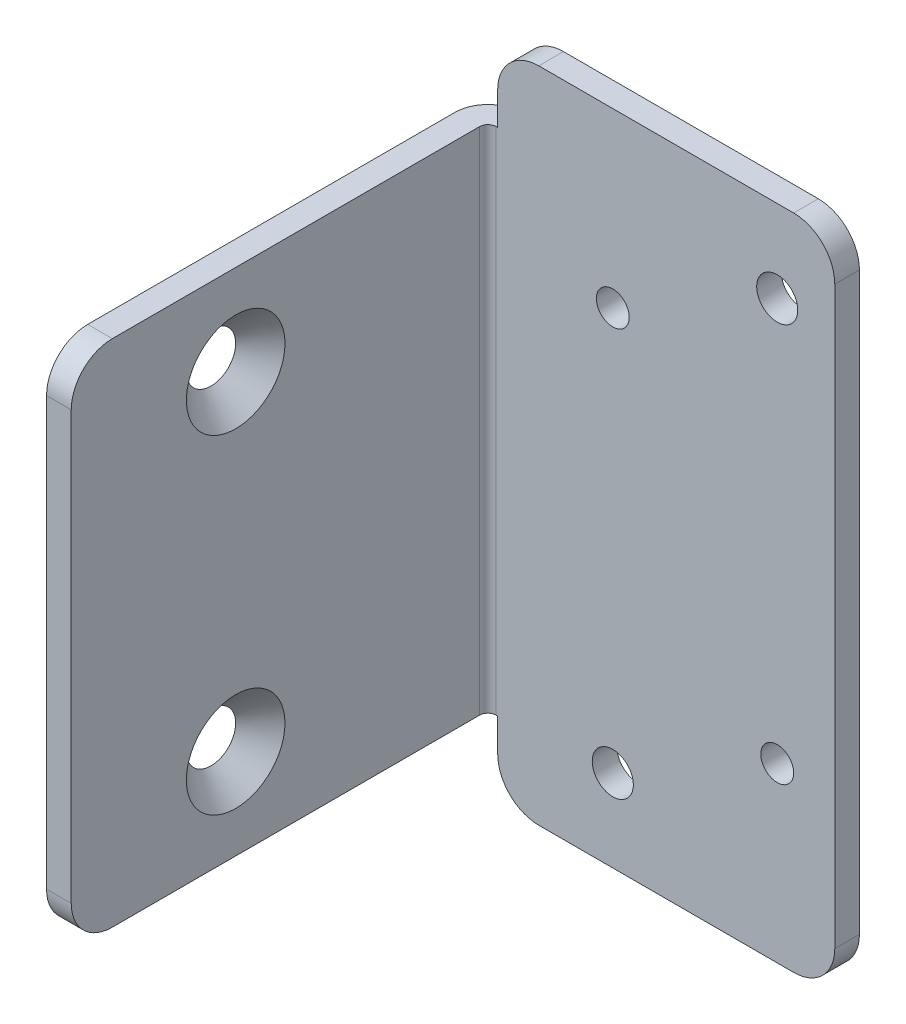
ISO-10303-21;
HEADER;
FILE_DESCRIPTION(('STEP AP214'),'2;1');
FILE_NAME('part.step','',(''),(''),'','','');
FILE_SCHEMA(('AUTOMOTIVE_DESIGN { 1 0 10303 214 1 1 1 1 }'));
ENDSEC;
DATA;
#1=APPLICATION_CONTEXT('core data for automotive mechanical design processes');
#2=APPLICATION_PROTOCOL_DEFINITION('international standard','automotive_design',2000,#1);
#3=PRODUCT_CONTEXT('',#1,'mechanical');
#4=PRODUCT('Part','Part','',(#3));
#5=PRODUCT_RELATED_PRODUCT_CATEGORY('part','',(#4));
#6=PRODUCT_DEFINITION_FORMATION('','',#4);
#7=PRODUCT_DEFINITION_CONTEXT('part definition',#1,'design');
#8=PRODUCT_DEFINITION('design','',#6,#7);
#9=PRODUCT_DEFINITION_SHAPE('','',#8);
#10=(LENGTH_UNIT() NAMED_UNIT(*) SI_UNIT(.MILLI.,.METRE.));
#11=(NAMED_UNIT(*) PLANE_ANGLE_UNIT() SI_UNIT($,.RADIAN.));
#12=(NAMED_UNIT(*) SI_UNIT($,.STERADIAN.) SOLID_ANGLE_UNIT());
#13=UNCERTAINTY_MEASURE_WITH_UNIT(LENGTH_MEASURE(1.E-05),#10,'distance_accuracy_value','');
#14=(GEOMETRIC_REPRESENTATION_CONTEXT(3) GLOBAL_UNCERTAINTY_ASSIGNED_CONTEXT((#13)) GLOBAL_UNIT_ASSIGNED_CONTEXT((#10,
#11,#12)) REPRESENTATION_CONTEXT('',''));
#15=CARTESIAN_POINT('',(0.,0.,0.));
#16=DIRECTION('',(0.,0.,1.));
#17=DIRECTION('',(1.,0.,0.));
#18=AXIS2_PLACEMENT_3D('',#15,#16,#17);
#19=CARTESIAN_POINT('',(-42.2,14.,53.6741153096782));
#20=DIRECTION('',(0.,0.,-1.));
#21=DIRECTION('',(-1.,0.,0.));
#22=AXIS2_PLACEMENT_3D('',#19,#20,#21);
#23=PLANE('',#22);
#24=DIRECTION('',(0.,1.,0.));
#25=VECTOR('',#24,1.);
#26=CARTESIAN_POINT('',(-42.2,75.,53.6741153096782));
#27=LINE('',#26,#25);
#28=CARTESIAN_POINT('',(-42.2,14.,53.6741153096782));
#29=VERTEX_POINT('',#28);
#30=CARTESIAN_POINT('',(-42.2,66.,53.6741153096782));
#31=VERTEX_POINT('',#30);
#32=EDGE_CURVE('E151',#29,#31,#27,.T.);
#33=ORIENTED_EDGE('',*,*,#32,.T.);
#34=DIRECTION('',(-1.,0.,0.));
#35=VECTOR('',#34,1.);
#36=CARTESIAN_POINT('',(-42.2,66.,53.6741153096782));
#37=LINE('',#36,#35);
#38=CARTESIAN_POINT('',(-45.2,66.,53.6741153096782));
#39=VERTEX_POINT('',#38);
#40=EDGE_CURVE('E193',#39,#31,#37,.F.);
#41=ORIENTED_EDGE('',*,*,#40,.F.);
#42=DIRECTION('',(0.,1.,0.));
#43=VECTOR('',#42,1.);
#44=CARTESIAN_POINT('',(-45.2,75.,53.6741153096782));
#45=LINE('',#44,#43);
#46=CARTESIAN_POINT('',(-45.2,14.,53.6741153096782));
#47=VERTEX_POINT('',#46);
#48=EDGE_CURVE('E158',#47,#39,#45,.T.);
#49=ORIENTED_EDGE('',*,*,#48,.F.);
#50=DIRECTION('',(-1.,0.,0.));
#51=VECTOR('',#50,1.);
#52=CARTESIAN_POINT('',(-42.2,14.,53.6741153096782));
#53=LINE('',#52,#51);
#54=EDGE_CURVE('E152',#29,#47,#53,.T.);
#55=ORIENTED_EDGE('',*,*,#54,.F.);
#56=EDGE_LOOP('',(#33,#41,#49,#55));
#57=FACE_BOUND('',#56,.T.);
#58=ADVANCED_FACE('F17',(#57),#23,.F.);
#59=CARTESIAN_POINT('',(-42.2,14.,48.6741153096782));
#60=DIRECTION('',(-1.,0.,0.));
#61=DIRECTION('',(0.,0.,1.));
#62=AXIS2_PLACEMENT_3D('',#59,#60,#61);
#63=CYLINDRICAL_SURFACE('',#62,5.);
#64=CARTESIAN_POINT('',(-45.2,14.,48.6741153096782));
#65=DIRECTION('',(-1.,0.,0.));
#66=DIRECTION('',(0.,0.,1.));
#67=AXIS2_PLACEMENT_3D('',#64,#65,#66);
#68=CIRCLE('',#67,5.);
#69=CARTESIAN_POINT('',(-45.2,9.,48.6741153096782));
#70=VERTEX_POINT('',#69);
#71=EDGE_CURVE('E140',#70,#47,#68,.T.);
#72=ORIENTED_EDGE('',*,*,#71,.F.);
#73=DIRECTION('',(-1.,0.,0.));
#74=VECTOR('',#73,1.);
#75=CARTESIAN_POINT('',(-41.,9.,48.6741153096782));
#76=LINE('',#75,#74);
#77=CARTESIAN_POINT('',(-42.2,9.,48.6741153096782));
#78=VERTEX_POINT('',#77);
#79=EDGE_CURVE('E134',#70,#78,#76,.F.);
#80=ORIENTED_EDGE('',*,*,#79,.T.);
#81=CARTESIAN_POINT('',(-42.2,14.,48.6741153096782));
#82=DIRECTION('',(-1.,0.,0.));
#83=DIRECTION('',(0.,0.,1.));
#84=AXIS2_PLACEMENT_3D('',#81,#82,#83);
#85=CIRCLE('',#84,5.);
#86=EDGE_CURVE('E20',#78,#29,#85,.T.);
#87=ORIENTED_EDGE('',*,*,#86,.T.);
#88=ORIENTED_EDGE('',*,*,#54,.T.);
#89=EDGE_LOOP('',(#72,#80,#87,#88));
#90=FACE_BOUND('',#89,.T.);
#91=ADVANCED_FACE('F136',(#90),#63,.T.);
#92=CARTESIAN_POINT('',(-42.1999999999798,20.,33.6741153096782));
#93=DIRECTION('',(1.,0.,0.));
#94=DIRECTION('',(0.,0.,-1.));
#95=AXIS2_PLACEMENT_3D('',#92,#93,#94);
#96=CONICAL_SURFACE('',#95,6.00000000002724,0.785398163397443);
#97=CARTESIAN_POINT('',(-42.1999999999797,20.,33.6741153096782));
#98=DIRECTION('',(1.,0.,0.));
#99=DIRECTION('',(0.,0.,-1.));
#100=AXIS2_PLACEMENT_3D('',#97,#98,#99);
#101=CIRCLE('',#100,6.00000000002727);
#102=CARTESIAN_POINT('',(-42.1999999999798,20.,27.6741153096509));
#103=VERTEX_POINT('',#102);
#104=EDGE_CURVE('E191',#103,#103,#101,.T.);
#105=ORIENTED_EDGE('',*,*,#104,.T.);
#106=EDGE_LOOP('',(#105));
#107=FACE_BOUND('',#106,.T.);
#108=CARTESIAN_POINT('',(-45.1999999999657,20.,33.6741153096782));
#109=DIRECTION('',(1.,0.,0.));
#110=DIRECTION('',(0.,0.,-1.));
#111=AXIS2_PLACEMENT_3D('',#108,#109,#110);
#112=CIRCLE('',#111,3.00000000004134);
#113=CARTESIAN_POINT('',(-45.1999999999657,20.,30.6741153096368));
#114=VERTEX_POINT('',#113);
#115=EDGE_CURVE('E265',#114,#114,#112,.T.);
#116=ORIENTED_EDGE('',*,*,#115,.F.);
#117=EDGE_LOOP('',(#116));
#118=FACE_BOUND('',#117,.T.);
#119=ADVANCED_FACE('F280',(#107,#118),#96,.F.);
#120=CARTESIAN_POINT('',(-42.1999999999798,60.,33.6741153096782));
#121=DIRECTION('',(1.,0.,0.));
#122=DIRECTION('',(0.,0.,-1.));
#123=AXIS2_PLACEMENT_3D('',#120,#121,#122);
#124=CONICAL_SURFACE('',#123,6.00000000002724,0.785398163397443);
#125=CARTESIAN_POINT('',(-42.1999999999797,60.,33.6741153096782));
#126=DIRECTION('',(1.,0.,0.));
#127=DIRECTION('',(0.,0.,-1.));
#128=AXIS2_PLACEMENT_3D('',#125,#126,#127);
#129=CIRCLE('',#128,6.00000000002727);
#130=CARTESIAN_POINT('',(-42.1999999999798,60.,27.6741153096509));
#131=VERTEX_POINT('',#130);
#132=EDGE_CURVE('E275',#131,#131,#129,.T.);
#133=ORIENTED_EDGE('',*,*,#132,.T.);
#134=EDGE_LOOP('',(#133));
#135=FACE_BOUND('',#134,.T.);
#136=CARTESIAN_POINT('',(-45.1999999999657,60.,33.6741153096782));
#137=DIRECTION('',(1.,0.,0.));
#138=DIRECTION('',(0.,0.,-1.));
#139=AXIS2_PLACEMENT_3D('',#136,#137,#138);
#140=CIRCLE('',#139,3.00000000004134);
#141=CARTESIAN_POINT('',(-45.1999999999657,60.,30.6741153096368));
#142=VERTEX_POINT('',#141);
#143=EDGE_CURVE('E262',#142,#142,#140,.T.);
#144=ORIENTED_EDGE('',*,*,#143,.F.);
#145=EDGE_LOOP('',(#144));
#146=FACE_BOUND('',#145,.T.);
#147=ADVANCED_FACE('F285',(#135,#146),#124,.F.);
#148=CARTESIAN_POINT('',(-42.2,75.,-4.32588469032185));
#149=DIRECTION('',(-1.,0.,0.));
#150=DIRECTION('',(0.,0.,1.));
#151=AXIS2_PLACEMENT_3D('',#148,#149,#150);
#152=PLANE('',#151);
#153=ORIENTED_EDGE('',*,*,#132,.F.);
#154=EDGE_LOOP('',(#153));
#155=FACE_BOUND('',#154,.T.);
#156=ORIENTED_EDGE('',*,*,#104,.F.);
#157=EDGE_LOOP('',(#156));
#158=FACE_BOUND('',#157,.T.);
#159=CARTESIAN_POINT('',(-42.2,66.,48.6741153096782));
#160=DIRECTION('',(-1.,0.,0.));
#161=DIRECTION('',(0.,0.,1.));
#162=AXIS2_PLACEMENT_3D('',#159,#160,#161);
#163=CIRCLE('',#162,5.);
#164=CARTESIAN_POINT('',(-42.2000000072099,71.,48.6741153096782));
#165=VERTEX_POINT('',#164);
#166=EDGE_CURVE('E196',#31,#165,#163,.T.);
#167=ORIENTED_EDGE('',*,*,#166,.F.);
#168=ORIENTED_EDGE('',*,*,#32,.F.);
#169=ORIENTED_EDGE('',*,*,#86,.F.);
#170=DIRECTION('',(0.,0.,1.));
#171=VECTOR('',#170,1.);
#172=CARTESIAN_POINT('',(-42.2,9.,3.));
#173=LINE('',#172,#171);
#174=CARTESIAN_POINT('',(-42.2000000144198,9.,4.));
#175=VERTEX_POINT('',#174);
#176=EDGE_CURVE('E144',#78,#175,#173,.F.);
#177=ORIENTED_EDGE('',*,*,#176,.T.);
#178=DIRECTION('',(0.,-1.,0.));
#179=VECTOR('',#178,1.);
#180=CARTESIAN_POINT('',(-42.2000000288397,102.151195926524,4.));
#181=LINE('',#180,#179);
#182=CARTESIAN_POINT('',(-42.2000000216298,71.,4.));
#183=VERTEX_POINT('',#182);
#184=EDGE_CURVE('E164',#175,#183,#181,.F.);
#185=ORIENTED_EDGE('',*,*,#184,.T.);
#186=DIRECTION('',(0.,0.,-1.));
#187=VECTOR('',#186,1.);
#188=CARTESIAN_POINT('',(-42.2000000144198,71.,3.));
#189=LINE('',#188,#187);
#190=EDGE_CURVE('E189',#183,#165,#189,.F.);
#191=ORIENTED_EDGE('',*,*,#190,.T.);
#192=EDGE_LOOP('',(#167,#168,#169,#177,#185,#191));
#193=FACE_BOUND('',#192,.T.);
#194=ADVANCED_FACE('F149',(#155,#158,#193),#152,.F.);
#195=CARTESIAN_POINT('',(-42.2,66.,48.6741153096782));
#196=DIRECTION('',(-1.,0.,0.));
#197=DIRECTION('',(0.,0.,1.));
#198=AXIS2_PLACEMENT_3D('',#195,#196,#197);
#199=CYLINDRICAL_SURFACE('',#198,5.);
#200=CARTESIAN_POINT('',(-45.2,66.,48.6741153096782));
#201=DIRECTION('',(-1.,0.,0.));
#202=DIRECTION('',(0.,0.,1.));
#203=AXIS2_PLACEMENT_3D('',#200,#201,#202);
#204=CIRCLE('',#203,5.);
#205=CARTESIAN_POINT('',(-45.2,71.,48.6741153096782));
#206=VERTEX_POINT('',#205);
#207=EDGE_CURVE('E270',#39,#206,#204,.T.);
#208=ORIENTED_EDGE('',*,*,#207,.F.);
#209=ORIENTED_EDGE('',*,*,#40,.T.);
#210=ORIENTED_EDGE('',*,*,#166,.T.);
#211=DIRECTION('',(1.,0.,0.));
#212=VECTOR('',#211,1.);
#213=CARTESIAN_POINT('',(-41.,71.,48.6741153096782));
#214=LINE('',#213,#212);
#215=EDGE_CURVE('E186',#165,#206,#214,.F.);
#216=ORIENTED_EDGE('',*,*,#215,.T.);
#217=EDGE_LOOP('',(#208,#209,#210,#216));
#218=FACE_BOUND('',#217,.T.);
#219=ADVANCED_FACE('F284',(#218),#199,.T.);
#220=CARTESIAN_POINT('',(-41.2,102.151195926524,4.));
#221=DIRECTION('',(0.,-1.,0.));
#222=DIRECTION('',(1.,0.,0.));
#223=AXIS2_PLACEMENT_3D('',#220,#221,#222);
#224=CYLINDRICAL_SURFACE('',#223,1.00000002883972);
#225=CARTESIAN_POINT('',(-41.2,71.,4.));
#226=DIRECTION('',(0.,-1.,0.));
#227=DIRECTION('',(1.,0.,0.));
#228=AXIS2_PLACEMENT_3D('',#225,#226,#227);
#229=CIRCLE('',#228,1.00000002883972);
#230=CARTESIAN_POINT('',(-41.2,71.,3.));
#231=VERTEX_POINT('',#230);
#232=EDGE_CURVE('E259',#231,#183,#229,.F.);
#233=ORIENTED_EDGE('',*,*,#232,.T.);
#234=ORIENTED_EDGE('',*,*,#184,.F.);
#235=CARTESIAN_POINT('',(-41.2,9.,4.));
#236=DIRECTION('',(0.,-1.,0.));
#237=DIRECTION('',(1.,0.,0.));
#238=AXIS2_PLACEMENT_3D('',#235,#236,#237);
#239=CIRCLE('',#238,1.00000002883972);
#240=CARTESIAN_POINT('',(-41.2,9.,3.));
#241=VERTEX_POINT('',#240);
#242=EDGE_CURVE('E156',#175,#241,#239,.T.);
#243=ORIENTED_EDGE('',*,*,#242,.T.);
#244=DIRECTION('',(0.,1.,0.));
#245=VECTOR('',#244,1.);
#246=CARTESIAN_POINT('',(-41.2,75.,3.));
#247=LINE('',#246,#245);
#248=EDGE_CURVE('E179',#241,#231,#247,.T.);
#249=ORIENTED_EDGE('',*,*,#248,.T.);
#250=EDGE_LOOP('',(#233,#234,#243,#249));
#251=FACE_BOUND('',#250,.T.);
#252=ADVANCED_FACE('F294',(#251),#224,.F.);
#253=CARTESIAN_POINT('',(-41.,9.,3.));
#254=DIRECTION('',(0.,1.,0.));
#255=DIRECTION('',(-1.,0.,0.));
#256=AXIS2_PLACEMENT_3D('',#253,#254,#255);
#257=PLANE('',#256);
#258=ORIENTED_EDGE('',*,*,#242,.F.);
#259=ORIENTED_EDGE('',*,*,#176,.F.);
#260=ORIENTED_EDGE('',*,*,#79,.F.);
#261=DIRECTION('',(0.,0.,1.));
#262=VECTOR('',#261,1.);
#263=CARTESIAN_POINT('',(-45.2,9.,-4.32588469032183));
#264=LINE('',#263,#262);
#265=CARTESIAN_POINT('',(-45.2000000144198,9.,4.));
#266=VERTEX_POINT('',#265);
#267=EDGE_CURVE('E269',#266,#70,#264,.T.);
#268=ORIENTED_EDGE('',*,*,#267,.F.);
#269=CARTESIAN_POINT('',(-41.2,9.,4.));
#270=DIRECTION('',(0.,-1.,0.));
#271=DIRECTION('',(1.,0.,0.));
#272=AXIS2_PLACEMENT_3D('',#269,#270,#271);
#273=CIRCLE('',#272,4.00000002883971);
#274=CARTESIAN_POINT('',(-41.2,9.,0.));
#275=VERTEX_POINT('',#274);
#276=EDGE_CURVE('E176',#275,#266,#273,.F.);
#277=ORIENTED_EDGE('',*,*,#276,.F.);
#278=DIRECTION('',(-1.,0.,0.));
#279=VECTOR('',#278,1.);
#280=CARTESIAN_POINT('',(-41.,9.,0.));
#281=LINE('',#280,#279);
#282=CARTESIAN_POINT('',(-41.,9.,0.));
#283=VERTEX_POINT('',#282);
#284=EDGE_CURVE('E145',#283,#275,#281,.T.);
#285=ORIENTED_EDGE('',*,*,#284,.F.);
#286=DIRECTION('',(0.,0.,-1.));
#287=VECTOR('',#286,1.);
#288=CARTESIAN_POINT('',(-41.,9.,3.));
#289=LINE('',#288,#287);
#290=CARTESIAN_POINT('',(-41.,9.,3.));
#291=VERTEX_POINT('',#290);
#292=EDGE_CURVE('E250',#283,#291,#289,.F.);
#293=ORIENTED_EDGE('',*,*,#292,.T.);
#294=DIRECTION('',(-1.,0.,0.));
#295=VECTOR('',#294,1.);
#296=CARTESIAN_POINT('',(-36.,9.,3.));
#297=LINE('',#296,#295);
#298=EDGE_CURVE('E177',#291,#241,#297,.T.);
#299=ORIENTED_EDGE('',*,*,#298,.T.);
#300=EDGE_LOOP('',(#258,#259,#260,#268,#277,#285,#293,#299));
#301=FACE_BOUND('',#300,.T.);
#302=ADVANCED_FACE('F154',(#301),#257,.F.);
#303=CARTESIAN_POINT('',(-45.2,75.,-4.32588469032183));
#304=DIRECTION('',(-1.,0.,0.));
#305=DIRECTION('',(0.,0.,1.));
#306=AXIS2_PLACEMENT_3D('',#303,#304,#305);
#307=PLANE('',#306);
#308=ORIENTED_EDGE('',*,*,#143,.T.);
#309=EDGE_LOOP('',(#308));
#310=FACE_BOUND('',#309,.T.);
#311=ORIENTED_EDGE('',*,*,#115,.T.);
#312=EDGE_LOOP('',(#311));
#313=FACE_BOUND('',#312,.T.);
#314=ORIENTED_EDGE('',*,*,#267,.T.);
#315=ORIENTED_EDGE('',*,*,#71,.T.);
#316=ORIENTED_EDGE('',*,*,#48,.T.);
#317=ORIENTED_EDGE('',*,*,#207,.T.);
#318=DIRECTION('',(0.,0.,-1.));
#319=VECTOR('',#318,1.);
#320=CARTESIAN_POINT('',(-45.2,71.,3.));
#321=LINE('',#320,#319);
#322=CARTESIAN_POINT('',(-45.2000000144198,71.,4.));
#323=VERTEX_POINT('',#322);
#324=EDGE_CURVE('E188',#206,#323,#321,.T.);
#325=ORIENTED_EDGE('',*,*,#324,.T.);
#326=DIRECTION('',(0.,-1.,0.));
#327=VECTOR('',#326,1.);
#328=CARTESIAN_POINT('',(-45.2000000288397,102.151195926524,4.));
#329=LINE('',#328,#327);
#330=EDGE_CURVE('E172',#266,#323,#329,.F.);
#331=ORIENTED_EDGE('',*,*,#330,.F.);
#332=EDGE_LOOP('',(#314,#315,#316,#317,#325,#331));
#333=FACE_BOUND('',#332,.T.);
#334=ADVANCED_FACE('F372',(#310,#313,#333),#307,.T.);
#335=CARTESIAN_POINT('',(-41.,71.,3.));
#336=DIRECTION('',(0.,-1.,0.));
#337=DIRECTION('',(0.,0.,-1.));
#338=AXIS2_PLACEMENT_3D('',#335,#336,#337);
#339=PLANE('',#338);
#340=CARTESIAN_POINT('',(-41.2,71.,4.));
#341=DIRECTION('',(0.,-1.,0.));
#342=DIRECTION('',(1.,0.,0.));
#343=AXIS2_PLACEMENT_3D('',#340,#341,#342);
#344=CIRCLE('',#343,4.00000002883971);
#345=CARTESIAN_POINT('',(-41.2,71.,-7.20992796715558E-09));
#346=VERTEX_POINT('',#345);
#347=EDGE_CURVE('E243',#323,#346,#344,.T.);
#348=ORIENTED_EDGE('',*,*,#347,.F.);
#349=ORIENTED_EDGE('',*,*,#324,.F.);
#350=ORIENTED_EDGE('',*,*,#215,.F.);
#351=ORIENTED_EDGE('',*,*,#190,.F.);
#352=ORIENTED_EDGE('',*,*,#232,.F.);
#353=DIRECTION('',(-1.,0.,0.));
#354=VECTOR('',#353,1.);
#355=CARTESIAN_POINT('',(-36.,71.,3.));
#356=LINE('',#355,#354);
#357=CARTESIAN_POINT('',(-41.,71.,3.));
#358=VERTEX_POINT('',#357);
#359=EDGE_CURVE('E180',#231,#358,#356,.F.);
#360=ORIENTED_EDGE('',*,*,#359,.T.);
#361=DIRECTION('',(0.,0.,-1.));
#362=VECTOR('',#361,1.);
#363=CARTESIAN_POINT('',(-41.,71.,3.));
#364=LINE('',#363,#362);
#365=CARTESIAN_POINT('',(-41.,71.,-4.80661878933068E-09));
#366=VERTEX_POINT('',#365);
#367=EDGE_CURVE('E240',#358,#366,#364,.T.);
#368=ORIENTED_EDGE('',*,*,#367,.T.);
#369=DIRECTION('',(1.,0.,0.));
#370=VECTOR('',#369,1.);
#371=CARTESIAN_POINT('',(-41.,71.,-1.4419856367992E-08));
#372=LINE('',#371,#370);
#373=EDGE_CURVE('E396',#346,#366,#372,.T.);
#374=ORIENTED_EDGE('',*,*,#373,.F.);
#375=EDGE_LOOP('',(#348,#349,#350,#351,#352,#360,#368,#374));
#376=FACE_BOUND('',#375,.T.);
#377=ADVANCED_FACE('F368',(#376),#339,.F.);
#378=CARTESIAN_POINT('',(-36.,75.,3.));
#379=DIRECTION('',(0.,0.,-1.));
#380=DIRECTION('',(-1.,0.,0.));
#381=AXIS2_PLACEMENT_3D('',#378,#379,#380);
#382=PLANE('',#381);
#383=CARTESIAN_POINT('',(-27.,59.,3.));
#384=DIRECTION('',(0.,0.,-1.));
#385=DIRECTION('',(-1.,0.,0.));
#386=AXIS2_PLACEMENT_3D('',#383,#384,#385);
#387=CIRCLE('',#386,2.);
#388=CARTESIAN_POINT('',(-29.,59.,3.));
#389=VERTEX_POINT('',#388);
#390=EDGE_CURVE('E185',#389,#389,#387,.T.);
#391=ORIENTED_EDGE('',*,*,#390,.T.);
#392=EDGE_LOOP('',(#391));
#393=FACE_BOUND('',#392,.T.);
#394=CARTESIAN_POINT('',(-7.,21.,3.));
#395=DIRECTION('',(0.,0.,-1.));
#396=DIRECTION('',(-1.,0.,0.));
#397=AXIS2_PLACEMENT_3D('',#394,#395,#396);
#398=CIRCLE('',#397,2.);
#399=CARTESIAN_POINT('',(-9.,21.,3.));
#400=VERTEX_POINT('',#399);
#401=EDGE_CURVE('E254',#400,#400,#398,.T.);
#402=ORIENTED_EDGE('',*,*,#401,.T.);
#403=EDGE_LOOP('',(#402));
#404=FACE_BOUND('',#403,.T.);
#405=CARTESIAN_POINT('',(-7.,70.,3.));
#406=DIRECTION('',(0.,0.,-1.));
#407=DIRECTION('',(-1.,0.,0.));
#408=AXIS2_PLACEMENT_3D('',#405,#406,#407);
#409=CIRCLE('',#408,2.5);
#410=CARTESIAN_POINT('',(-9.5,70.,3.));
#411=VERTEX_POINT('',#410);
#412=EDGE_CURVE('E251',#411,#411,#409,.T.);
#413=ORIENTED_EDGE('',*,*,#412,.T.);
#414=EDGE_LOOP('',(#413));
#415=FACE_BOUND('',#414,.T.);
#416=CARTESIAN_POINT('',(-27.,10.,3.));
#417=DIRECTION('',(0.,0.,-1.));
#418=DIRECTION('',(-1.,0.,0.));
#419=AXIS2_PLACEMENT_3D('',#416,#417,#418);
#420=CIRCLE('',#419,2.5);
#421=CARTESIAN_POINT('',(-29.5,10.,3.));
#422=VERTEX_POINT('',#421);
#423=EDGE_CURVE('E247',#422,#422,#420,.T.);
#424=ORIENTED_EDGE('',*,*,#423,.T.);
#425=EDGE_LOOP('',(#424));
#426=FACE_BOUND('',#425,.T.);
#427=ORIENTED_EDGE('',*,*,#298,.F.);
#428=DIRECTION('',(0.,1.,0.));
#429=VECTOR('',#428,1.);
#430=CARTESIAN_POINT('',(-41.,5.,3.));
#431=LINE('',#430,#429);
#432=CARTESIAN_POINT('',(-41.,5.,3.));
#433=VERTEX_POINT('',#432);
#434=EDGE_CURVE('E246',#291,#433,#431,.F.);
#435=ORIENTED_EDGE('',*,*,#434,.T.);
#436=CARTESIAN_POINT('',(-36.,5.,3.));
#437=DIRECTION('',(0.,0.,-1.));
#438=DIRECTION('',(-1.,0.,0.));
#439=AXIS2_PLACEMENT_3D('',#436,#437,#438);
#440=CIRCLE('',#439,5.);
#441=CARTESIAN_POINT('',(-36.,0.,3.));
#442=VERTEX_POINT('',#441);
#443=EDGE_CURVE('E221',#442,#433,#440,.T.);
#444=ORIENTED_EDGE('',*,*,#443,.F.);
#445=DIRECTION('',(-1.,0.,0.));
#446=VECTOR('',#445,1.);
#447=CARTESIAN_POINT('',(-5.,0.,3.));
#448=LINE('',#447,#446);
#449=CARTESIAN_POINT('',(-5.,0.,3.));
#450=VERTEX_POINT('',#449);
#451=EDGE_CURVE('E422',#442,#450,#448,.F.);
#452=ORIENTED_EDGE('',*,*,#451,.T.);
#453=CARTESIAN_POINT('',(-5.,5.,3.));
#454=DIRECTION('',(0.,0.,-1.));
#455=DIRECTION('',(-1.,0.,0.));
#456=AXIS2_PLACEMENT_3D('',#453,#454,#455);
#457=CIRCLE('',#456,5.);
#458=CARTESIAN_POINT('',(0.,5.,3.));
#459=VERTEX_POINT('',#458);
#460=EDGE_CURVE('E226',#459,#450,#457,.T.);
#461=ORIENTED_EDGE('',*,*,#460,.F.);
#462=DIRECTION('',(0.,1.,0.));
#463=VECTOR('',#462,1.);
#464=CARTESIAN_POINT('',(0.,5.,3.));
#465=LINE('',#464,#463);
#466=CARTESIAN_POINT('',(0.,75.,3.));
#467=VERTEX_POINT('',#466);
#468=EDGE_CURVE('E426',#459,#467,#465,.T.);
#469=ORIENTED_EDGE('',*,*,#468,.T.);
#470=CARTESIAN_POINT('',(-5.,75.,3.));
#471=DIRECTION('',(0.,0.,-1.));
#472=DIRECTION('',(-1.,0.,0.));
#473=AXIS2_PLACEMENT_3D('',#470,#471,#472);
#474=CIRCLE('',#473,5.);
#475=CARTESIAN_POINT('',(-5.,80.,3.));
#476=VERTEX_POINT('',#475);
#477=EDGE_CURVE('E231',#476,#467,#474,.T.);
#478=ORIENTED_EDGE('',*,*,#477,.F.);
#479=DIRECTION('',(1.,0.,0.));
#480=VECTOR('',#479,1.);
#481=CARTESIAN_POINT('',(-5.,80.,3.));
#482=LINE('',#481,#480);
#483=CARTESIAN_POINT('',(-36.,80.,3.));
#484=VERTEX_POINT('',#483);
#485=EDGE_CURVE('E430',#476,#484,#482,.F.);
#486=ORIENTED_EDGE('',*,*,#485,.T.);
#487=CARTESIAN_POINT('',(-36.,75.,3.));
#488=DIRECTION('',(0.,0.,-1.));
#489=DIRECTION('',(-1.,0.,0.));
#490=AXIS2_PLACEMENT_3D('',#487,#488,#489);
#491=CIRCLE('',#490,5.);
#492=CARTESIAN_POINT('',(-41.,75.,3.));
#493=VERTEX_POINT('',#492);
#494=EDGE_CURVE('E236',#493,#484,#491,.T.);
#495=ORIENTED_EDGE('',*,*,#494,.F.);
#496=DIRECTION('',(0.,1.,0.));
#497=VECTOR('',#496,1.);
#498=CARTESIAN_POINT('',(-41.,71.,3.));
#499=LINE('',#498,#497);
#500=EDGE_CURVE('E175',#493,#358,#499,.F.);
#501=ORIENTED_EDGE('',*,*,#500,.T.);
#502=ORIENTED_EDGE('',*,*,#359,.F.);
#503=ORIENTED_EDGE('',*,*,#248,.F.);
#504=EDGE_LOOP('',(#427,#435,#444,#452,#461,#469,#478,#486,#495,#501,#502,#503));
#505=FACE_BOUND('',#504,.T.);
#506=ADVANCED_FACE('F364',(#393,#404,#415,#426,#505),#382,.F.);
#507=CARTESIAN_POINT('',(-27.,59.,3.));
#508=DIRECTION('',(0.,0.,-1.));
#509=DIRECTION('',(-1.,0.,0.));
#510=AXIS2_PLACEMENT_3D('',#507,#508,#509);
#511=CYLINDRICAL_SURFACE('',#510,2.);
#512=ORIENTED_EDGE('',*,*,#390,.F.);
#513=EDGE_LOOP('',(#512));
#514=FACE_BOUND('',#513,.T.);
#515=CARTESIAN_POINT('',(-27.,59.,0.));
#516=DIRECTION('',(0.,0.,-1.));
#517=DIRECTION('',(-1.,0.,0.));
#518=AXIS2_PLACEMENT_3D('',#515,#516,#517);
#519=CIRCLE('',#518,2.);
#520=CARTESIAN_POINT('',(-29.,59.,0.));
#521=VERTEX_POINT('',#520);
#522=EDGE_CURVE('E218',#521,#521,#519,.F.);
#523=ORIENTED_EDGE('',*,*,#522,.F.);
#524=EDGE_LOOP('',(#523));
#525=FACE_BOUND('',#524,.T.);
#526=ADVANCED_FACE('F360',(#514,#525),#511,.F.);
#527=CARTESIAN_POINT('',(-7.,21.,3.));
#528=DIRECTION('',(0.,0.,-1.));
#529=DIRECTION('',(-1.,0.,0.));
#530=AXIS2_PLACEMENT_3D('',#527,#528,#529);
#531=CYLINDRICAL_SURFACE('',#530,2.);
#532=ORIENTED_EDGE('',*,*,#401,.F.);
#533=EDGE_LOOP('',(#532));
#534=FACE_BOUND('',#533,.T.);
#535=CARTESIAN_POINT('',(-7.,21.,0.));
#536=DIRECTION('',(0.,0.,-1.));
#537=DIRECTION('',(-1.,0.,0.));
#538=AXIS2_PLACEMENT_3D('',#535,#536,#537);
#539=CIRCLE('',#538,2.);
#540=CARTESIAN_POINT('',(-9.,21.,0.));
#541=VERTEX_POINT('',#540);
#542=EDGE_CURVE('E215',#541,#541,#539,.F.);
#543=ORIENTED_EDGE('',*,*,#542,.F.);
#544=EDGE_LOOP('',(#543));
#545=FACE_BOUND('',#544,.T.);
#546=ADVANCED_FACE('F356',(#534,#545),#531,.F.);
#547=CARTESIAN_POINT('',(-7.,70.,3.));
#548=DIRECTION('',(0.,0.,-1.));
#549=DIRECTION('',(-1.,0.,0.));
#550=AXIS2_PLACEMENT_3D('',#547,#548,#549);
#551=CYLINDRICAL_SURFACE('',#550,2.5);
#552=ORIENTED_EDGE('',*,*,#412,.F.);
#553=EDGE_LOOP('',(#552));
#554=FACE_BOUND('',#553,.T.);
#555=CARTESIAN_POINT('',(-7.,70.,0.));
#556=DIRECTION('',(0.,0.,-1.));
#557=DIRECTION('',(-1.,0.,0.));
#558=AXIS2_PLACEMENT_3D('',#555,#556,#557);
#559=CIRCLE('',#558,2.5);
#560=CARTESIAN_POINT('',(-9.5,70.,0.));
#561=VERTEX_POINT('',#560);
#562=EDGE_CURVE('E212',#561,#561,#559,.F.);
#563=ORIENTED_EDGE('',*,*,#562,.F.);
#564=EDGE_LOOP('',(#563));
#565=FACE_BOUND('',#564,.T.);
#566=ADVANCED_FACE('F352',(#554,#565),#551,.F.);
#567=CARTESIAN_POINT('',(-27.,10.,3.));
#568=DIRECTION('',(0.,0.,-1.));
#569=DIRECTION('',(-1.,0.,0.));
#570=AXIS2_PLACEMENT_3D('',#567,#568,#569);
#571=CYLINDRICAL_SURFACE('',#570,2.5);
#572=ORIENTED_EDGE('',*,*,#423,.F.);
#573=EDGE_LOOP('',(#572));
#574=FACE_BOUND('',#573,.T.);
#575=CARTESIAN_POINT('',(-27.,10.,0.));
#576=DIRECTION('',(0.,0.,-1.));
#577=DIRECTION('',(-1.,0.,0.));
#578=AXIS2_PLACEMENT_3D('',#575,#576,#577);
#579=CIRCLE('',#578,2.5);
#580=CARTESIAN_POINT('',(-29.5,10.,0.));
#581=VERTEX_POINT('',#580);
#582=EDGE_CURVE('E209',#581,#581,#579,.F.);
#583=ORIENTED_EDGE('',*,*,#582,.F.);
#584=EDGE_LOOP('',(#583));
#585=FACE_BOUND('',#584,.T.);
#586=ADVANCED_FACE('F348',(#574,#585),#571,.F.);
#587=CARTESIAN_POINT('',(-41.,5.,3.));
#588=DIRECTION('',(1.,0.,0.));
#589=DIRECTION('',(0.,0.,-1.));
#590=AXIS2_PLACEMENT_3D('',#587,#588,#589);
#591=PLANE('',#590);
#592=ORIENTED_EDGE('',*,*,#434,.F.);
#593=ORIENTED_EDGE('',*,*,#292,.F.);
#594=DIRECTION('',(0.,1.,0.));
#595=VECTOR('',#594,1.);
#596=CARTESIAN_POINT('',(-41.,75.,0.));
#597=LINE('',#596,#595);
#598=CARTESIAN_POINT('',(-41.,5.,0.));
#599=VERTEX_POINT('',#598);
#600=EDGE_CURVE('E171',#599,#283,#597,.T.);
#601=ORIENTED_EDGE('',*,*,#600,.F.);
#602=DIRECTION('',(0.,0.,-1.));
#603=VECTOR('',#602,1.);
#604=CARTESIAN_POINT('',(-41.,5.,3.));
#605=LINE('',#604,#603);
#606=EDGE_CURVE('E224',#433,#599,#605,.T.);
#607=ORIENTED_EDGE('',*,*,#606,.F.);
#608=EDGE_LOOP('',(#592,#593,#601,#607));
#609=FACE_BOUND('',#608,.T.);
#610=ADVANCED_FACE('F344',(#609),#591,.F.);
#611=CARTESIAN_POINT('',(-41.2,102.151195926524,4.));
#612=DIRECTION('',(0.,-1.,0.));
#613=DIRECTION('',(1.,0.,0.));
#614=AXIS2_PLACEMENT_3D('',#611,#612,#613);
#615=CYLINDRICAL_SURFACE('',#614,4.00000002883971);
#616=ORIENTED_EDGE('',*,*,#276,.T.);
#617=ORIENTED_EDGE('',*,*,#330,.T.);
#618=ORIENTED_EDGE('',*,*,#347,.T.);
#619=DIRECTION('',(0.,1.,0.));
#620=VECTOR('',#619,1.);
#621=CARTESIAN_POINT('',(-41.2,75.,0.));
#622=LINE('',#621,#620);
#623=EDGE_CURVE('E167',#275,#346,#622,.T.);
#624=ORIENTED_EDGE('',*,*,#623,.F.);
#625=EDGE_LOOP('',(#616,#617,#618,#624));
#626=FACE_BOUND('',#625,.T.);
#627=ADVANCED_FACE('F340',(#626),#615,.T.);
#628=CARTESIAN_POINT('',(-41.,71.,3.));
#629=DIRECTION('',(1.,0.,0.));
#630=DIRECTION('',(0.,0.,-1.));
#631=AXIS2_PLACEMENT_3D('',#628,#629,#630);
#632=PLANE('',#631);
#633=ORIENTED_EDGE('',*,*,#500,.F.);
#634=DIRECTION('',(0.,0.,-1.));
#635=VECTOR('',#634,1.);
#636=CARTESIAN_POINT('',(-41.,75.,3.));
#637=LINE('',#636,#635);
#638=CARTESIAN_POINT('',(-41.,75.,0.));
#639=VERTEX_POINT('',#638);
#640=EDGE_CURVE('E239',#639,#493,#637,.F.);
#641=ORIENTED_EDGE('',*,*,#640,.F.);
#642=DIRECTION('',(0.,1.,0.));
#643=VECTOR('',#642,1.);
#644=CARTESIAN_POINT('',(-41.,75.,0.));
#645=LINE('',#644,#643);
#646=EDGE_CURVE('E170',#366,#639,#645,.T.);
#647=ORIENTED_EDGE('',*,*,#646,.F.);
#648=ORIENTED_EDGE('',*,*,#367,.F.);
#649=EDGE_LOOP('',(#633,#641,#647,#648));
#650=FACE_BOUND('',#649,.T.);
#651=ADVANCED_FACE('F336',(#650),#632,.F.);
#652=CARTESIAN_POINT('',(-36.,75.,3.));
#653=DIRECTION('',(0.,0.,-1.));
#654=DIRECTION('',(-1.,0.,0.));
#655=AXIS2_PLACEMENT_3D('',#652,#653,#654);
#656=CYLINDRICAL_SURFACE('',#655,5.);
#657=CARTESIAN_POINT('',(-36.,75.,0.));
#658=DIRECTION('',(0.,0.,-1.));
#659=DIRECTION('',(-1.,0.,0.));
#660=AXIS2_PLACEMENT_3D('',#657,#658,#659);
#661=CIRCLE('',#660,5.);
#662=CARTESIAN_POINT('',(-36.,80.,0.));
#663=VERTEX_POINT('',#662);
#664=EDGE_CURVE('E206',#639,#663,#661,.T.);
#665=ORIENTED_EDGE('',*,*,#664,.F.);
#666=ORIENTED_EDGE('',*,*,#640,.T.);
#667=ORIENTED_EDGE('',*,*,#494,.T.);
#668=DIRECTION('',(0.,0.,1.));
#669=VECTOR('',#668,1.);
#670=CARTESIAN_POINT('',(-36.,80.,3.));
#671=LINE('',#670,#669);
#672=EDGE_CURVE('E235',#484,#663,#671,.F.);
#673=ORIENTED_EDGE('',*,*,#672,.T.);
#674=EDGE_LOOP('',(#665,#666,#667,#673));
#675=FACE_BOUND('',#674,.T.);
#676=ADVANCED_FACE('F332',(#675),#656,.T.);
#677=CARTESIAN_POINT('',(-5.,80.,3.));
#678=DIRECTION('',(0.,-1.,0.));
#679=DIRECTION('',(1.,0.,0.));
#680=AXIS2_PLACEMENT_3D('',#677,#678,#679);
#681=PLANE('',#680);
#682=ORIENTED_EDGE('',*,*,#485,.F.);
#683=DIRECTION('',(0.,0.,-1.));
#684=VECTOR('',#683,1.);
#685=CARTESIAN_POINT('',(-5.,80.,3.));
#686=LINE('',#685,#684);
#687=CARTESIAN_POINT('',(-5.,80.,0.));
#688=VERTEX_POINT('',#687);
#689=EDGE_CURVE('E234',#688,#476,#686,.F.);
#690=ORIENTED_EDGE('',*,*,#689,.F.);
#691=DIRECTION('',(-1.,0.,0.));
#692=VECTOR('',#691,1.);
#693=CARTESIAN_POINT('',(-36.,80.,0.));
#694=LINE('',#693,#692);
#695=EDGE_CURVE('E205',#663,#688,#694,.F.);
#696=ORIENTED_EDGE('',*,*,#695,.F.);
#697=ORIENTED_EDGE('',*,*,#672,.F.);
#698=EDGE_LOOP('',(#682,#690,#696,#697));
#699=FACE_BOUND('',#698,.T.);
#700=ADVANCED_FACE('F328',(#699),#681,.F.);
#701=CARTESIAN_POINT('',(-5.,75.,3.));
#702=DIRECTION('',(0.,0.,-1.));
#703=DIRECTION('',(-1.,0.,0.));
#704=AXIS2_PLACEMENT_3D('',#701,#702,#703);
#705=CYLINDRICAL_SURFACE('',#704,5.);
#706=CARTESIAN_POINT('',(-5.,75.,0.));
#707=DIRECTION('',(0.,0.,-1.));
#708=DIRECTION('',(-1.,0.,0.));
#709=AXIS2_PLACEMENT_3D('',#706,#707,#708);
#710=CIRCLE('',#709,5.);
#711=CARTESIAN_POINT('',(0.,75.,0.));
#712=VERTEX_POINT('',#711);
#713=EDGE_CURVE('E202',#688,#712,#710,.T.);
#714=ORIENTED_EDGE('',*,*,#713,.F.);
#715=ORIENTED_EDGE('',*,*,#689,.T.);
#716=ORIENTED_EDGE('',*,*,#477,.T.);
#717=DIRECTION('',(0.,0.,1.));
#718=VECTOR('',#717,1.);
#719=CARTESIAN_POINT('',(0.,75.,3.));
#720=LINE('',#719,#718);
#721=EDGE_CURVE('E230',#467,#712,#720,.F.);
#722=ORIENTED_EDGE('',*,*,#721,.T.);
#723=EDGE_LOOP('',(#714,#715,#716,#722));
#724=FACE_BOUND('',#723,.T.);
#725=ADVANCED_FACE('F324',(#724),#705,.T.);
#726=CARTESIAN_POINT('',(0.,5.,3.));
#727=DIRECTION('',(-1.,0.,0.));
#728=DIRECTION('',(0.,0.,1.));
#729=AXIS2_PLACEMENT_3D('',#726,#727,#728);
#730=PLANE('',#729);
#731=ORIENTED_EDGE('',*,*,#468,.F.);
#732=DIRECTION('',(0.,0.,-1.));
#733=VECTOR('',#732,1.);
#734=CARTESIAN_POINT('',(0.,5.,3.));
#735=LINE('',#734,#733);
#736=CARTESIAN_POINT('',(0.,5.,0.));
#737=VERTEX_POINT('',#736);
#738=EDGE_CURVE('E229',#737,#459,#735,.F.);
#739=ORIENTED_EDGE('',*,*,#738,.F.);
#740=DIRECTION('',(0.,1.,0.));
#741=VECTOR('',#740,1.);
#742=CARTESIAN_POINT('',(0.,75.,0.));
#743=LINE('',#742,#741);
#744=EDGE_CURVE('E201',#712,#737,#743,.F.);
#745=ORIENTED_EDGE('',*,*,#744,.F.);
#746=ORIENTED_EDGE('',*,*,#721,.F.);
#747=EDGE_LOOP('',(#731,#739,#745,#746));
#748=FACE_BOUND('',#747,.T.);
#749=ADVANCED_FACE('F320',(#748),#730,.F.);
#750=CARTESIAN_POINT('',(-5.,5.,3.));
#751=DIRECTION('',(0.,0.,-1.));
#752=DIRECTION('',(-1.,0.,0.));
#753=AXIS2_PLACEMENT_3D('',#750,#751,#752);
#754=CYLINDRICAL_SURFACE('',#753,5.);
#755=CARTESIAN_POINT('',(-5.,5.,0.));
#756=DIRECTION('',(0.,0.,-1.));
#757=DIRECTION('',(-1.,0.,0.));
#758=AXIS2_PLACEMENT_3D('',#755,#756,#757);
#759=CIRCLE('',#758,5.);
#760=CARTESIAN_POINT('',(-5.,0.,0.));
#761=VERTEX_POINT('',#760);
#762=EDGE_CURVE('E198',#737,#761,#759,.T.);
#763=ORIENTED_EDGE('',*,*,#762,.F.);
#764=ORIENTED_EDGE('',*,*,#738,.T.);
#765=ORIENTED_EDGE('',*,*,#460,.T.);
#766=DIRECTION('',(0.,0.,1.));
#767=VECTOR('',#766,1.);
#768=CARTESIAN_POINT('',(-5.,0.,3.));
#769=LINE('',#768,#767);
#770=EDGE_CURVE('E225',#450,#761,#769,.F.);
#771=ORIENTED_EDGE('',*,*,#770,.T.);
#772=EDGE_LOOP('',(#763,#764,#765,#771));
#773=FACE_BOUND('',#772,.T.);
#774=ADVANCED_FACE('F317',(#773),#754,.T.);
#775=CARTESIAN_POINT('',(-5.,0.,3.));
#776=DIRECTION('',(0.,1.,0.));
#777=DIRECTION('',(-1.,0.,0.));
#778=AXIS2_PLACEMENT_3D('',#775,#776,#777);
#779=PLANE('',#778);
#780=ORIENTED_EDGE('',*,*,#451,.F.);
#781=DIRECTION('',(0.,0.,-1.));
#782=VECTOR('',#781,1.);
#783=CARTESIAN_POINT('',(-36.,0.,3.));
#784=LINE('',#783,#782);
#785=CARTESIAN_POINT('',(-36.,0.,0.));
#786=VERTEX_POINT('',#785);
#787=EDGE_CURVE('E35',#786,#442,#784,.F.);
#788=ORIENTED_EDGE('',*,*,#787,.F.);
#789=DIRECTION('',(-1.,0.,0.));
#790=VECTOR('',#789,1.);
#791=CARTESIAN_POINT('',(-36.,0.,0.));
#792=LINE('',#791,#790);
#793=EDGE_CURVE('E26',#761,#786,#792,.T.);
#794=ORIENTED_EDGE('',*,*,#793,.F.);
#795=ORIENTED_EDGE('',*,*,#770,.F.);
#796=EDGE_LOOP('',(#780,#788,#794,#795));
#797=FACE_BOUND('',#796,.T.);
#798=ADVANCED_FACE('F309',(#797),#779,.F.);
#799=CARTESIAN_POINT('',(-36.,5.,3.));
#800=DIRECTION('',(0.,0.,-1.));
#801=DIRECTION('',(-1.,0.,0.));
#802=AXIS2_PLACEMENT_3D('',#799,#800,#801);
#803=CYLINDRICAL_SURFACE('',#802,5.);
#804=CARTESIAN_POINT('',(-36.,5.,0.));
#805=DIRECTION('',(0.,0.,-1.));
#806=DIRECTION('',(-1.,0.,0.));
#807=AXIS2_PLACEMENT_3D('',#804,#805,#806);
#808=CIRCLE('',#807,5.);
#809=EDGE_CURVE('E11',#786,#599,#808,.T.);
#810=ORIENTED_EDGE('',*,*,#809,.F.);
#811=ORIENTED_EDGE('',*,*,#787,.T.);
#812=ORIENTED_EDGE('',*,*,#443,.T.);
#813=ORIENTED_EDGE('',*,*,#606,.T.);
#814=EDGE_LOOP('',(#810,#811,#812,#813));
#815=FACE_BOUND('',#814,.T.);
#816=ADVANCED_FACE('F302',(#815),#803,.T.);
#817=CARTESIAN_POINT('',(-36.,75.,0.));
#818=DIRECTION('',(0.,0.,-1.));
#819=DIRECTION('',(-1.,0.,0.));
#820=AXIS2_PLACEMENT_3D('',#817,#818,#819);
#821=PLANE('',#820);
#822=ORIENTED_EDGE('',*,*,#793,.T.);
#823=ORIENTED_EDGE('',*,*,#809,.T.);
#824=ORIENTED_EDGE('',*,*,#600,.T.);
#825=ORIENTED_EDGE('',*,*,#284,.T.);
#826=ORIENTED_EDGE('',*,*,#623,.T.);
#827=ORIENTED_EDGE('',*,*,#373,.T.);
#828=ORIENTED_EDGE('',*,*,#646,.T.);
#829=ORIENTED_EDGE('',*,*,#664,.T.);
#830=ORIENTED_EDGE('',*,*,#695,.T.);
#831=ORIENTED_EDGE('',*,*,#713,.T.);
#832=ORIENTED_EDGE('',*,*,#744,.T.);
#833=ORIENTED_EDGE('',*,*,#762,.T.);
#834=EDGE_LOOP('',(#822,#823,#824,#825,#826,#827,#828,#829,#830,#831,#832,#833));
#835=FACE_BOUND('',#834,.T.);
#836=ORIENTED_EDGE('',*,*,#582,.T.);
#837=EDGE_LOOP('',(#836));
#838=FACE_BOUND('',#837,.T.);
#839=ORIENTED_EDGE('',*,*,#562,.T.);
#840=EDGE_LOOP('',(#839));
#841=FACE_BOUND('',#840,.T.);
#842=ORIENTED_EDGE('',*,*,#542,.T.);
#843=EDGE_LOOP('',(#842));
#844=FACE_BOUND('',#843,.T.);
#845=ORIENTED_EDGE('',*,*,#522,.T.);
#846=EDGE_LOOP('',(#845));
#847=FACE_BOUND('',#846,.T.);
#848=ADVANCED_FACE('F300',(#835,#838,#841,#844,#847),#821,.T.);
#849=CLOSED_SHELL('',(#58,#91,#119,#147,#194,#219,#252,#302,#334,#377,#506,#526,#546,#566,#586,
#610,#627,#651,#676,#700,#725,#749,#774,#798,#816,#848));
#850=MANIFOLD_SOLID_BREP('B1',#849);
#851=ADVANCED_BREP_SHAPE_REPRESENTATION('',(#18,#850),#14);
#852=SHAPE_DEFINITION_REPRESENTATION(#9,#851);
ENDSEC;
END-ISO-10303-21;
